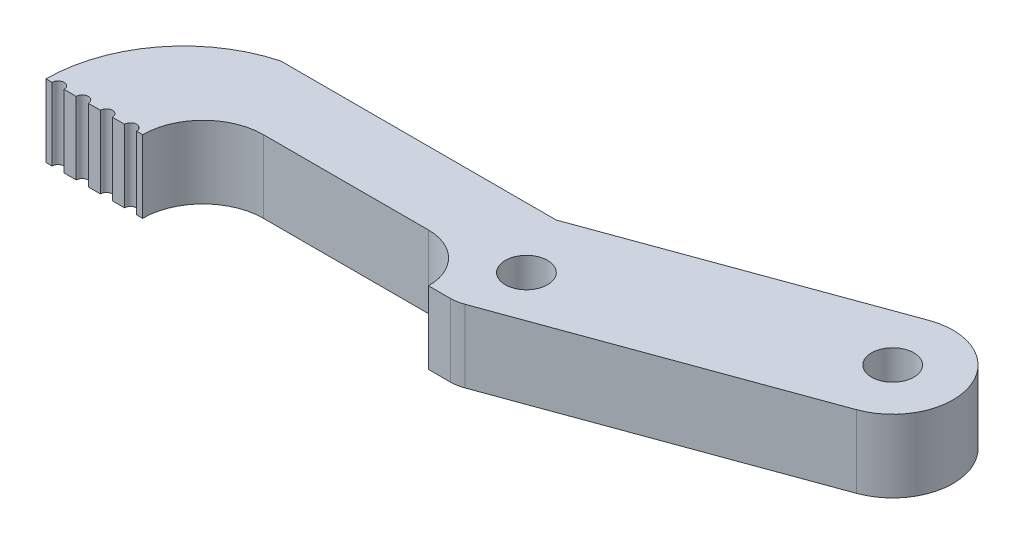
ISO-10303-21;
HEADER;
FILE_DESCRIPTION(('STEP AP214'),'2;1');
FILE_NAME('part.step','',(''),(''),'','','');
FILE_SCHEMA(('AUTOMOTIVE_DESIGN { 1 0 10303 214 1 1 1 1 }'));
ENDSEC;
DATA;
#1=APPLICATION_CONTEXT('core data for automotive mechanical design processes');
#2=APPLICATION_PROTOCOL_DEFINITION('international standard','automotive_design',2000,#1);
#3=PRODUCT_CONTEXT('',#1,'mechanical');
#4=PRODUCT('Part','Part','',(#3));
#5=PRODUCT_RELATED_PRODUCT_CATEGORY('part','',(#4));
#6=PRODUCT_DEFINITION_FORMATION('','',#4);
#7=PRODUCT_DEFINITION_CONTEXT('part definition',#1,'design');
#8=PRODUCT_DEFINITION('design','',#6,#7);
#9=PRODUCT_DEFINITION_SHAPE('','',#8);
#10=(LENGTH_UNIT() NAMED_UNIT(*) SI_UNIT(.MILLI.,.METRE.));
#11=(NAMED_UNIT(*) PLANE_ANGLE_UNIT() SI_UNIT($,.RADIAN.));
#12=(NAMED_UNIT(*) SI_UNIT($,.STERADIAN.) SOLID_ANGLE_UNIT());
#13=UNCERTAINTY_MEASURE_WITH_UNIT(LENGTH_MEASURE(1.E-05),#10,'distance_accuracy_value','');
#14=(GEOMETRIC_REPRESENTATION_CONTEXT(3) GLOBAL_UNCERTAINTY_ASSIGNED_CONTEXT((#13)) GLOBAL_UNIT_ASSIGNED_CONTEXT((#10,
#11,#12)) REPRESENTATION_CONTEXT('',''));
#15=CARTESIAN_POINT('',(0.,0.,0.));
#16=DIRECTION('',(0.,0.,1.));
#17=DIRECTION('',(1.,0.,0.));
#18=AXIS2_PLACEMENT_3D('',#15,#16,#17);
#19=CARTESIAN_POINT('',(-3.99167378230842,6.,0.));
#20=DIRECTION('',(0.,0.,-1.));
#21=DIRECTION('',(-1.,0.,0.));
#22=AXIS2_PLACEMENT_3D('',#19,#20,#21);
#23=PLANE('',#22);
#24=DIRECTION('',(1.,0.,0.));
#25=VECTOR('',#24,1.);
#26=CARTESIAN_POINT('',(-3.99167378230842,0.,0.));
#27=LINE('',#26,#25);
#28=CARTESIAN_POINT('',(-3.99167378230842,0.,0.));
#29=VERTEX_POINT('',#28);
#30=CARTESIAN_POINT('',(-3.49167378230842,0.,0.));
#31=VERTEX_POINT('',#30);
#32=EDGE_CURVE('E242',#29,#31,#27,.T.);
#33=ORIENTED_EDGE('',*,*,#32,.T.);
#34=DIRECTION('',(0.,1.,0.));
#35=VECTOR('',#34,1.);
#36=CARTESIAN_POINT('',(-3.49167378230842,0.,0.));
#37=LINE('',#36,#35);
#38=CARTESIAN_POINT('',(-3.49167378230842,6.,0.));
#39=VERTEX_POINT('',#38);
#40=EDGE_CURVE('E13',#31,#39,#37,.T.);
#41=ORIENTED_EDGE('',*,*,#40,.T.);
#42=DIRECTION('',(1.,0.,0.));
#43=VECTOR('',#42,1.);
#44=CARTESIAN_POINT('',(-3.99167378230842,6.,0.));
#45=LINE('',#44,#43);
#46=CARTESIAN_POINT('',(-3.99167378230842,6.,0.));
#47=VERTEX_POINT('',#46);
#48=EDGE_CURVE('E209',#47,#39,#45,.T.);
#49=ORIENTED_EDGE('',*,*,#48,.F.);
#50=DIRECTION('',(0.,-1.,0.));
#51=VECTOR('',#50,1.);
#52=CARTESIAN_POINT('',(-3.99167378230842,6.,0.));
#53=LINE('',#52,#51);
#54=EDGE_CURVE('E294',#47,#29,#53,.T.);
#55=ORIENTED_EDGE('',*,*,#54,.T.);
#56=EDGE_LOOP('',(#33,#41,#49,#55));
#57=FACE_BOUND('',#56,.T.);
#58=ADVANCED_FACE('F48',(#57),#23,.F.);
#59=CARTESIAN_POINT('',(-2.49167378230842,6.,0.));
#60=VERTEX_POINT('',#59);
#61=CARTESIAN_POINT('',(-1.49167378230842,6.,0.));
#62=VERTEX_POINT('',#61);
#63=EDGE_CURVE('E207',#60,#62,#45,.T.);
#64=ORIENTED_EDGE('',*,*,#63,.F.);
#65=DIRECTION('',(0.,1.,0.));
#66=VECTOR('',#65,1.);
#67=CARTESIAN_POINT('',(-2.49167378230842,0.,0.));
#68=LINE('',#67,#66);
#69=CARTESIAN_POINT('',(-2.49167378230842,0.,0.));
#70=VERTEX_POINT('',#69);
#71=EDGE_CURVE('E57',#60,#70,#68,.F.);
#72=ORIENTED_EDGE('',*,*,#71,.T.);
#73=CARTESIAN_POINT('',(-1.49167378230842,0.,0.));
#74=VERTEX_POINT('',#73);
#75=EDGE_CURVE('E246',#70,#74,#27,.T.);
#76=ORIENTED_EDGE('',*,*,#75,.T.);
#77=DIRECTION('',(0.,1.,0.));
#78=VECTOR('',#77,1.);
#79=CARTESIAN_POINT('',(-1.49167378230842,0.,0.));
#80=LINE('',#79,#78);
#81=EDGE_CURVE('E314',#74,#62,#80,.T.);
#82=ORIENTED_EDGE('',*,*,#81,.T.);
#83=EDGE_LOOP('',(#64,#72,#76,#82));
#84=FACE_BOUND('',#83,.T.);
#85=ADVANCED_FACE('F321',(#84),#23,.F.);
#86=CARTESIAN_POINT('',(1.50832621769158,0.,0.));
#87=VERTEX_POINT('',#86);
#88=CARTESIAN_POINT('',(2.50832621769158,0.,0.));
#89=VERTEX_POINT('',#88);
#90=EDGE_CURVE('E335',#87,#89,#27,.T.);
#91=ORIENTED_EDGE('',*,*,#90,.T.);
#92=DIRECTION('',(0.,1.,0.));
#93=VECTOR('',#92,1.);
#94=CARTESIAN_POINT('',(2.50832621769158,0.,0.));
#95=LINE('',#94,#93);
#96=CARTESIAN_POINT('',(2.50832621769158,6.,0.));
#97=VERTEX_POINT('',#96);
#98=EDGE_CURVE('E204',#89,#97,#95,.T.);
#99=ORIENTED_EDGE('',*,*,#98,.T.);
#100=CARTESIAN_POINT('',(1.50832621769158,6.,0.));
#101=VERTEX_POINT('',#100);
#102=EDGE_CURVE('E197',#101,#97,#45,.T.);
#103=ORIENTED_EDGE('',*,*,#102,.F.);
#104=DIRECTION('',(0.,1.,0.));
#105=VECTOR('',#104,1.);
#106=CARTESIAN_POINT('',(1.50832621769158,0.,0.));
#107=LINE('',#106,#105);
#108=EDGE_CURVE('E177',#101,#87,#107,.F.);
#109=ORIENTED_EDGE('',*,*,#108,.T.);
#110=EDGE_LOOP('',(#91,#99,#103,#109));
#111=FACE_BOUND('',#110,.T.);
#112=ADVANCED_FACE('F203',(#111),#23,.F.);
#113=CARTESIAN_POINT('',(-0.491673782308424,6.,0.));
#114=VERTEX_POINT('',#113);
#115=CARTESIAN_POINT('',(0.508326217691576,6.,0.));
#116=VERTEX_POINT('',#115);
#117=EDGE_CURVE('E200',#114,#116,#45,.T.);
#118=ORIENTED_EDGE('',*,*,#117,.F.);
#119=DIRECTION('',(0.,1.,0.));
#120=VECTOR('',#119,1.);
#121=CARTESIAN_POINT('',(-0.491673782308424,0.,0.));
#122=LINE('',#121,#120);
#123=CARTESIAN_POINT('',(-0.491673782308424,0.,0.));
#124=VERTEX_POINT('',#123);
#125=EDGE_CURVE('E311',#114,#124,#122,.F.);
#126=ORIENTED_EDGE('',*,*,#125,.T.);
#127=CARTESIAN_POINT('',(0.508326217691576,0.,0.));
#128=VERTEX_POINT('',#127);
#129=EDGE_CURVE('E333',#124,#128,#27,.T.);
#130=ORIENTED_EDGE('',*,*,#129,.T.);
#131=DIRECTION('',(0.,1.,0.));
#132=VECTOR('',#131,1.);
#133=CARTESIAN_POINT('',(0.508326217691576,0.,0.));
#134=LINE('',#133,#132);
#135=EDGE_CURVE('E187',#128,#116,#134,.T.);
#136=ORIENTED_EDGE('',*,*,#135,.T.);
#137=EDGE_LOOP('',(#118,#126,#130,#136));
#138=FACE_BOUND('',#137,.T.);
#139=ADVANCED_FACE('F412',(#138),#23,.F.);
#140=CARTESIAN_POINT('',(7.39771594295677,6.,0.));
#141=DIRECTION('',(0.,-1.,0.));
#142=DIRECTION('',(0.,0.,-1.));
#143=AXIS2_PLACEMENT_3D('',#140,#141,#142);
#144=PLANE('',#143);
#145=ORIENTED_EDGE('',*,*,#48,.T.);
#146=CARTESIAN_POINT('',(-2.99167378230842,6.,0.));
#147=DIRECTION('',(0.,1.,0.));
#148=DIRECTION('',(0.,0.,-1.));
#149=AXIS2_PLACEMENT_3D('',#146,#147,#148);
#150=CIRCLE('',#149,0.5);
#151=EDGE_CURVE('E368',#60,#39,#150,.T.);
#152=ORIENTED_EDGE('',*,*,#151,.F.);
#153=ORIENTED_EDGE('',*,*,#63,.T.);
#154=CARTESIAN_POINT('',(-0.991673782308424,6.,0.));
#155=DIRECTION('',(0.,1.,0.));
#156=DIRECTION('',(0.,0.,-1.));
#157=AXIS2_PLACEMENT_3D('',#154,#155,#156);
#158=CIRCLE('',#157,0.5);
#159=EDGE_CURVE('E363',#114,#62,#158,.T.);
#160=ORIENTED_EDGE('',*,*,#159,.F.);
#161=ORIENTED_EDGE('',*,*,#117,.T.);
#162=CARTESIAN_POINT('',(1.00832621769158,6.,0.));
#163=DIRECTION('',(0.,1.,0.));
#164=DIRECTION('',(0.,0.,1.));
#165=AXIS2_PLACEMENT_3D('',#162,#163,#164);
#166=CIRCLE('',#165,0.5);
#167=EDGE_CURVE('E180',#101,#116,#166,.T.);
#168=ORIENTED_EDGE('',*,*,#167,.F.);
#169=ORIENTED_EDGE('',*,*,#102,.T.);
#170=CARTESIAN_POINT('',(3.00832621769158,6.,0.));
#171=DIRECTION('',(0.,1.,0.));
#172=DIRECTION('',(0.,0.,1.));
#173=AXIS2_PLACEMENT_3D('',#170,#171,#172);
#174=CIRCLE('',#173,0.5);
#175=CARTESIAN_POINT('',(3.50832621769158,6.,0.));
#176=VERTEX_POINT('',#175);
#177=EDGE_CURVE('E360',#176,#97,#174,.T.);
#178=ORIENTED_EDGE('',*,*,#177,.F.);
#179=CARTESIAN_POINT('',(4.00832621769158,6.,0.));
#180=VERTEX_POINT('',#179);
#181=EDGE_CURVE('E205',#176,#180,#45,.T.);
#182=ORIENTED_EDGE('',*,*,#181,.T.);
#183=CARTESIAN_POINT('',(9.00832621769158,6.,0.));
#184=DIRECTION('',(0.,-1.,0.));
#185=DIRECTION('',(0.,0.,-1.));
#186=AXIS2_PLACEMENT_3D('',#183,#184,#185);
#187=CIRCLE('',#186,5.);
#188=CARTESIAN_POINT('',(9.00832621769158,6.,-5.));
#189=VERTEX_POINT('',#188);
#190=EDGE_CURVE('E212',#180,#189,#187,.T.);
#191=ORIENTED_EDGE('',*,*,#190,.T.);
#192=DIRECTION('',(1.,0.,0.));
#193=VECTOR('',#192,1.);
#194=CARTESIAN_POINT('',(9.00832621769158,6.,-5.));
#195=LINE('',#194,#193);
#196=CARTESIAN_POINT('',(22.6817866035223,6.,-5.));
#197=VERTEX_POINT('',#196);
#198=EDGE_CURVE('E215',#189,#197,#195,.T.);
#199=ORIENTED_EDGE('',*,*,#198,.T.);
#200=CARTESIAN_POINT('',(22.6817866035223,6.,-0.999999999999999));
#201=DIRECTION('',(0.,-1.,0.));
#202=DIRECTION('',(0.,0.,-1.));
#203=AXIS2_PLACEMENT_3D('',#200,#201,#202);
#204=CIRCLE('',#203,4.);
#205=CARTESIAN_POINT('',(26.6817866035223,6.,-0.999999999999999));
#206=VERTEX_POINT('',#205);
#207=EDGE_CURVE('E218',#197,#206,#204,.T.);
#208=ORIENTED_EDGE('',*,*,#207,.T.);
#209=DIRECTION('',(1.,0.,0.));
#210=VECTOR('',#209,1.);
#211=CARTESIAN_POINT('',(26.6817866035223,6.,-0.999999999999999));
#212=LINE('',#211,#210);
#213=CARTESIAN_POINT('',(28.4793452755662,6.,-0.999999999999999));
#214=VERTEX_POINT('',#213);
#215=EDGE_CURVE('E221',#206,#214,#212,.T.);
#216=ORIENTED_EDGE('',*,*,#215,.T.);
#217=CARTESIAN_POINT('',(28.4793452755662,6.,-4.));
#218=DIRECTION('',(0.,-1.,0.));
#219=DIRECTION('',(0.,0.,-1.));
#220=AXIS2_PLACEMENT_3D('',#217,#218,#219);
#221=CIRCLE('',#220,3.);
#222=CARTESIAN_POINT('',(29.5054057055432,6.,-1.18092213764228));
#223=VERTEX_POINT('',#222);
#224=EDGE_CURVE('E188',#214,#223,#221,.F.);
#225=ORIENTED_EDGE('',*,*,#224,.T.);
#226=DIRECTION('',(0.939692620785908,0.,-0.34202014332567));
#227=VECTOR('',#226,1.);
#228=CARTESIAN_POINT('',(29.0083262176916,6.,-0.999999999999999));
#229=LINE('',#228,#227);
#230=CARTESIAN_POINT('',(53.2806502121784,6.,-9.83440345045856));
#231=VERTEX_POINT('',#230);
#232=EDGE_CURVE('E225',#223,#231,#229,.T.);
#233=ORIENTED_EDGE('',*,*,#232,.T.);
#234=CARTESIAN_POINT('',(51.57054949555,6.,-14.5328665543881));
#235=DIRECTION('',(0.,1.,0.));
#236=DIRECTION('',(0.,0.,1.));
#237=AXIS2_PLACEMENT_3D('',#234,#235,#236);
#238=CIRCLE('',#237,5.);
#239=CARTESIAN_POINT('',(49.8604487789217,6.,-19.2313296583176));
#240=VERTEX_POINT('',#239);
#241=EDGE_CURVE('E228',#231,#240,#238,.T.);
#242=ORIENTED_EDGE('',*,*,#241,.T.);
#243=DIRECTION('',(-0.939692620785908,0.,0.34202014332567));
#244=VECTOR('',#243,1.);
#245=CARTESIAN_POINT('',(27.2450564106069,6.,-11.));
#246=LINE('',#245,#244);
#247=CARTESIAN_POINT('',(27.2450564106069,6.,-11.));
#248=VERTEX_POINT('',#247);
#249=EDGE_CURVE('E230',#240,#248,#246,.T.);
#250=ORIENTED_EDGE('',*,*,#249,.T.);
#251=DIRECTION('',(-1.,0.,0.));
#252=VECTOR('',#251,1.);
#253=CARTESIAN_POINT('',(4.44505641060692,6.,-11.));
#254=LINE('',#253,#252);
#255=CARTESIAN_POINT('',(4.44505641060692,6.,-11.));
#256=VERTEX_POINT('',#255);
#257=EDGE_CURVE('E233',#248,#256,#254,.T.);
#258=ORIENTED_EDGE('',*,*,#257,.T.);
#259=CARTESIAN_POINT('',(7.39771594295677,6.,0.));
#260=DIRECTION('',(0.,1.,0.));
#261=DIRECTION('',(0.,0.,-1.));
#262=AXIS2_PLACEMENT_3D('',#259,#260,#261);
#263=CIRCLE('',#262,11.3893897252652);
#264=EDGE_CURVE('E208',#256,#47,#263,.T.);
#265=ORIENTED_EDGE('',*,*,#264,.T.);
#266=EDGE_LOOP('',(#145,#152,#153,#160,#161,#168,#169,#178,#182,#191,#199,#208,#216,#225,#233,
#242,#250,#258,#265));
#267=FACE_BOUND('',#266,.T.);
#268=CARTESIAN_POINT('',(51.57054949555,6.,-14.5328665543881));
#269=DIRECTION('',(0.,1.,0.));
#270=DIRECTION('',(0.,0.,1.));
#271=AXIS2_PLACEMENT_3D('',#268,#269,#270);
#272=CIRCLE('',#271,1.75);
#273=CARTESIAN_POINT('',(51.57054949555,6.,-12.7828665543881));
#274=VERTEX_POINT('',#273);
#275=EDGE_CURVE('E241',#274,#274,#272,.T.);
#276=ORIENTED_EDGE('',*,*,#275,.F.);
#277=EDGE_LOOP('',(#276));
#278=FACE_BOUND('',#277,.T.);
#279=CARTESIAN_POINT('',(29.7817866035223,6.,-6.));
#280=DIRECTION('',(0.,1.,0.));
#281=DIRECTION('',(0.,0.,1.));
#282=AXIS2_PLACEMENT_3D('',#279,#280,#281);
#283=CIRCLE('',#282,1.75);
#284=CARTESIAN_POINT('',(29.7817866035223,6.,-4.25));
#285=VERTEX_POINT('',#284);
#286=EDGE_CURVE('E372',#285,#285,#283,.T.);
#287=ORIENTED_EDGE('',*,*,#286,.F.);
#288=EDGE_LOOP('',(#287));
#289=FACE_BOUND('',#288,.T.);
#290=ADVANCED_FACE('F194',(#267,#278,#289),#144,.F.);
#291=CARTESIAN_POINT('',(7.39771594295677,0.,0.));
#292=DIRECTION('',(0.,-1.,0.));
#293=DIRECTION('',(0.,0.,-1.));
#294=AXIS2_PLACEMENT_3D('',#291,#292,#293);
#295=PLANE('',#294);
#296=CARTESIAN_POINT('',(-2.99167378230842,0.,0.));
#297=DIRECTION('',(0.,1.,0.));
#298=DIRECTION('',(0.,0.,-1.));
#299=AXIS2_PLACEMENT_3D('',#296,#297,#298);
#300=CIRCLE('',#299,0.5);
#301=EDGE_CURVE('E330',#70,#31,#300,.T.);
#302=ORIENTED_EDGE('',*,*,#301,.T.);
#303=ORIENTED_EDGE('',*,*,#32,.F.);
#304=CARTESIAN_POINT('',(7.39771594295677,0.,0.));
#305=DIRECTION('',(0.,1.,0.));
#306=DIRECTION('',(0.,0.,-1.));
#307=AXIS2_PLACEMENT_3D('',#304,#305,#306);
#308=CIRCLE('',#307,11.3893897252652);
#309=CARTESIAN_POINT('',(4.44505641060692,0.,-11.));
#310=VERTEX_POINT('',#309);
#311=EDGE_CURVE('E237',#310,#29,#308,.T.);
#312=ORIENTED_EDGE('',*,*,#311,.F.);
#313=DIRECTION('',(-1.,0.,0.));
#314=VECTOR('',#313,1.);
#315=CARTESIAN_POINT('',(4.44505641060692,0.,-11.));
#316=LINE('',#315,#314);
#317=CARTESIAN_POINT('',(27.2450564106069,0.,-11.));
#318=VERTEX_POINT('',#317);
#319=EDGE_CURVE('E267',#318,#310,#316,.T.);
#320=ORIENTED_EDGE('',*,*,#319,.F.);
#321=DIRECTION('',(-0.939692620785908,0.,0.34202014332567));
#322=VECTOR('',#321,1.);
#323=CARTESIAN_POINT('',(27.2450564106069,0.,-11.));
#324=LINE('',#323,#322);
#325=CARTESIAN_POINT('',(49.8604487789217,0.,-19.2313296583176));
#326=VERTEX_POINT('',#325);
#327=EDGE_CURVE('E264',#326,#318,#324,.T.);
#328=ORIENTED_EDGE('',*,*,#327,.F.);
#329=CARTESIAN_POINT('',(51.57054949555,0.,-14.5328665543881));
#330=DIRECTION('',(0.,1.,0.));
#331=DIRECTION('',(0.,0.,1.));
#332=AXIS2_PLACEMENT_3D('',#329,#330,#331);
#333=CIRCLE('',#332,5.);
#334=CARTESIAN_POINT('',(53.2806502121784,0.,-9.83440345045856));
#335=VERTEX_POINT('',#334);
#336=EDGE_CURVE('E261',#335,#326,#333,.T.);
#337=ORIENTED_EDGE('',*,*,#336,.F.);
#338=DIRECTION('',(0.939692620785908,0.,-0.34202014332567));
#339=VECTOR('',#338,1.);
#340=CARTESIAN_POINT('',(29.0083262176916,0.,-0.999999999999999));
#341=LINE('',#340,#339);
#342=CARTESIAN_POINT('',(29.5054057055432,0.,-1.18092213764228));
#343=VERTEX_POINT('',#342);
#344=EDGE_CURVE('E258',#343,#335,#341,.T.);
#345=ORIENTED_EDGE('',*,*,#344,.F.);
#346=CARTESIAN_POINT('',(28.4793452755662,0.,-4.));
#347=DIRECTION('',(0.,-1.,0.));
#348=DIRECTION('',(0.,0.,-1.));
#349=AXIS2_PLACEMENT_3D('',#346,#347,#348);
#350=CIRCLE('',#349,3.);
#351=CARTESIAN_POINT('',(28.4793452755662,0.,-0.999999999999999));
#352=VERTEX_POINT('',#351);
#353=EDGE_CURVE('E301',#343,#352,#350,.T.);
#354=ORIENTED_EDGE('',*,*,#353,.T.);
#355=DIRECTION('',(1.,0.,0.));
#356=VECTOR('',#355,1.);
#357=CARTESIAN_POINT('',(26.6817866035223,0.,-0.999999999999999));
#358=LINE('',#357,#356);
#359=CARTESIAN_POINT('',(26.6817866035223,0.,-0.999999999999999));
#360=VERTEX_POINT('',#359);
#361=EDGE_CURVE('E255',#360,#352,#358,.T.);
#362=ORIENTED_EDGE('',*,*,#361,.F.);
#363=CARTESIAN_POINT('',(22.6817866035223,0.,-0.999999999999999));
#364=DIRECTION('',(0.,-1.,0.));
#365=DIRECTION('',(0.,0.,-1.));
#366=AXIS2_PLACEMENT_3D('',#363,#364,#365);
#367=CIRCLE('',#366,4.);
#368=CARTESIAN_POINT('',(22.6817866035223,0.,-5.));
#369=VERTEX_POINT('',#368);
#370=EDGE_CURVE('E252',#369,#360,#367,.T.);
#371=ORIENTED_EDGE('',*,*,#370,.F.);
#372=DIRECTION('',(1.,0.,0.));
#373=VECTOR('',#372,1.);
#374=CARTESIAN_POINT('',(9.00832621769158,0.,-5.));
#375=LINE('',#374,#373);
#376=CARTESIAN_POINT('',(9.00832621769158,0.,-5.));
#377=VERTEX_POINT('',#376);
#378=EDGE_CURVE('E249',#377,#369,#375,.T.);
#379=ORIENTED_EDGE('',*,*,#378,.F.);
#380=CARTESIAN_POINT('',(9.00832621769158,0.,0.));
#381=DIRECTION('',(0.,-1.,0.));
#382=DIRECTION('',(0.,0.,-1.));
#383=AXIS2_PLACEMENT_3D('',#380,#381,#382);
#384=CIRCLE('',#383,5.);
#385=CARTESIAN_POINT('',(4.00832621769158,0.,0.));
#386=VERTEX_POINT('',#385);
#387=EDGE_CURVE('E245',#386,#377,#384,.T.);
#388=ORIENTED_EDGE('',*,*,#387,.F.);
#389=CARTESIAN_POINT('',(3.50832621769158,0.,0.));
#390=VERTEX_POINT('',#389);
#391=EDGE_CURVE('E240',#390,#386,#27,.T.);
#392=ORIENTED_EDGE('',*,*,#391,.F.);
#393=CARTESIAN_POINT('',(3.00832621769158,0.,0.));
#394=DIRECTION('',(0.,1.,0.));
#395=DIRECTION('',(0.,0.,1.));
#396=AXIS2_PLACEMENT_3D('',#393,#394,#395);
#397=CIRCLE('',#396,0.5);
#398=EDGE_CURVE('E64',#390,#89,#397,.T.);
#399=ORIENTED_EDGE('',*,*,#398,.T.);
#400=ORIENTED_EDGE('',*,*,#90,.F.);
#401=CARTESIAN_POINT('',(1.00832621769158,0.,0.));
#402=DIRECTION('',(0.,1.,0.));
#403=DIRECTION('',(0.,0.,1.));
#404=AXIS2_PLACEMENT_3D('',#401,#402,#403);
#405=CIRCLE('',#404,0.5);
#406=EDGE_CURVE('E72',#87,#128,#405,.T.);
#407=ORIENTED_EDGE('',*,*,#406,.T.);
#408=ORIENTED_EDGE('',*,*,#129,.F.);
#409=CARTESIAN_POINT('',(-0.991673782308424,0.,0.));
#410=DIRECTION('',(0.,1.,0.));
#411=DIRECTION('',(0.,0.,-1.));
#412=AXIS2_PLACEMENT_3D('',#409,#410,#411);
#413=CIRCLE('',#412,0.5);
#414=EDGE_CURVE('E332',#124,#74,#413,.T.);
#415=ORIENTED_EDGE('',*,*,#414,.T.);
#416=ORIENTED_EDGE('',*,*,#75,.F.);
#417=EDGE_LOOP('',(#302,#303,#312,#320,#328,#337,#345,#354,#362,#371,#379,#388,#392,#399,#400,
#407,#408,#415,#416));
#418=FACE_BOUND('',#417,.T.);
#419=CARTESIAN_POINT('',(51.57054949555,0.,-14.5328665543881));
#420=DIRECTION('',(0.,1.,0.));
#421=DIRECTION('',(0.,0.,1.));
#422=AXIS2_PLACEMENT_3D('',#419,#420,#421);
#423=CIRCLE('',#422,1.75);
#424=CARTESIAN_POINT('',(51.57054949555,0.,-12.7828665543881));
#425=VERTEX_POINT('',#424);
#426=EDGE_CURVE('E376',#425,#425,#423,.T.);
#427=ORIENTED_EDGE('',*,*,#426,.T.);
#428=EDGE_LOOP('',(#427));
#429=FACE_BOUND('',#428,.T.);
#430=CARTESIAN_POINT('',(29.7817866035223,0.,-6.));
#431=DIRECTION('',(0.,1.,0.));
#432=DIRECTION('',(0.,0.,1.));
#433=AXIS2_PLACEMENT_3D('',#430,#431,#432);
#434=CIRCLE('',#433,1.75);
#435=CARTESIAN_POINT('',(29.7817866035223,0.,-4.25));
#436=VERTEX_POINT('',#435);
#437=EDGE_CURVE('E370',#436,#436,#434,.T.);
#438=ORIENTED_EDGE('',*,*,#437,.T.);
#439=EDGE_LOOP('',(#438));
#440=FACE_BOUND('',#439,.T.);
#441=ADVANCED_FACE('F328',(#418,#429,#440),#295,.T.);
#442=CARTESIAN_POINT('',(7.39771594295677,6.,0.));
#443=DIRECTION('',(0.,-1.,0.));
#444=DIRECTION('',(0.,0.,-1.));
#445=AXIS2_PLACEMENT_3D('',#442,#443,#444);
#446=CYLINDRICAL_SURFACE('',#445,11.3893897252652);
#447=ORIENTED_EDGE('',*,*,#311,.T.);
#448=ORIENTED_EDGE('',*,*,#54,.F.);
#449=ORIENTED_EDGE('',*,*,#264,.F.);
#450=DIRECTION('',(0.,-1.,0.));
#451=VECTOR('',#450,1.);
#452=CARTESIAN_POINT('',(4.44505641060692,6.,-11.));
#453=LINE('',#452,#451);
#454=EDGE_CURVE('E236',#256,#310,#453,.T.);
#455=ORIENTED_EDGE('',*,*,#454,.T.);
#456=EDGE_LOOP('',(#447,#448,#449,#455));
#457=FACE_BOUND('',#456,.T.);
#458=ADVANCED_FACE('F411',(#457),#446,.T.);
#459=ORIENTED_EDGE('',*,*,#181,.F.);
#460=DIRECTION('',(0.,1.,0.));
#461=VECTOR('',#460,1.);
#462=CARTESIAN_POINT('',(3.50832621769158,0.,0.));
#463=LINE('',#462,#461);
#464=EDGE_CURVE('E308',#176,#390,#463,.F.);
#465=ORIENTED_EDGE('',*,*,#464,.T.);
#466=ORIENTED_EDGE('',*,*,#391,.T.);
#467=DIRECTION('',(0.,-1.,0.));
#468=VECTOR('',#467,1.);
#469=CARTESIAN_POINT('',(4.00832621769158,6.,0.));
#470=LINE('',#469,#468);
#471=EDGE_CURVE('E291',#180,#386,#470,.T.);
#472=ORIENTED_EDGE('',*,*,#471,.F.);
#473=EDGE_LOOP('',(#459,#465,#466,#472));
#474=FACE_BOUND('',#473,.T.);
#475=ADVANCED_FACE('F341',(#474),#23,.F.);
#476=CARTESIAN_POINT('',(9.00832621769158,6.,0.));
#477=DIRECTION('',(0.,-1.,0.));
#478=DIRECTION('',(0.,0.,-1.));
#479=AXIS2_PLACEMENT_3D('',#476,#477,#478);
#480=CYLINDRICAL_SURFACE('',#479,5.);
#481=ORIENTED_EDGE('',*,*,#387,.T.);
#482=DIRECTION('',(0.,-1.,0.));
#483=VECTOR('',#482,1.);
#484=CARTESIAN_POINT('',(9.00832621769158,6.,-5.));
#485=LINE('',#484,#483);
#486=EDGE_CURVE('E288',#189,#377,#485,.T.);
#487=ORIENTED_EDGE('',*,*,#486,.F.);
#488=ORIENTED_EDGE('',*,*,#190,.F.);
#489=ORIENTED_EDGE('',*,*,#471,.T.);
#490=EDGE_LOOP('',(#481,#487,#488,#489));
#491=FACE_BOUND('',#490,.T.);
#492=ADVANCED_FACE('F345',(#491),#480,.F.);
#493=CARTESIAN_POINT('',(9.00832621769158,6.,-5.));
#494=DIRECTION('',(0.,0.,-1.));
#495=DIRECTION('',(-1.,0.,0.));
#496=AXIS2_PLACEMENT_3D('',#493,#494,#495);
#497=PLANE('',#496);
#498=ORIENTED_EDGE('',*,*,#378,.T.);
#499=DIRECTION('',(0.,-1.,0.));
#500=VECTOR('',#499,1.);
#501=CARTESIAN_POINT('',(22.6817866035223,6.,-5.));
#502=LINE('',#501,#500);
#503=EDGE_CURVE('E285',#197,#369,#502,.T.);
#504=ORIENTED_EDGE('',*,*,#503,.F.);
#505=ORIENTED_EDGE('',*,*,#198,.F.);
#506=ORIENTED_EDGE('',*,*,#486,.T.);
#507=EDGE_LOOP('',(#498,#504,#505,#506));
#508=FACE_BOUND('',#507,.T.);
#509=ADVANCED_FACE('F352',(#508),#497,.F.);
#510=CARTESIAN_POINT('',(22.6817866035223,6.,-0.999999999999999));
#511=DIRECTION('',(0.,-1.,0.));
#512=DIRECTION('',(0.,0.,-1.));
#513=AXIS2_PLACEMENT_3D('',#510,#511,#512);
#514=CYLINDRICAL_SURFACE('',#513,4.);
#515=ORIENTED_EDGE('',*,*,#370,.T.);
#516=DIRECTION('',(0.,-1.,0.));
#517=VECTOR('',#516,1.);
#518=CARTESIAN_POINT('',(26.6817866035223,6.,-0.999999999999999));
#519=LINE('',#518,#517);
#520=EDGE_CURVE('E282',#206,#360,#519,.T.);
#521=ORIENTED_EDGE('',*,*,#520,.F.);
#522=ORIENTED_EDGE('',*,*,#207,.F.);
#523=ORIENTED_EDGE('',*,*,#503,.T.);
#524=EDGE_LOOP('',(#515,#521,#522,#523));
#525=FACE_BOUND('',#524,.T.);
#526=ADVANCED_FACE('F356',(#525),#514,.F.);
#527=CARTESIAN_POINT('',(26.6817866035223,6.,-0.999999999999999));
#528=DIRECTION('',(0.,0.,-1.));
#529=DIRECTION('',(-1.,0.,0.));
#530=AXIS2_PLACEMENT_3D('',#527,#528,#529);
#531=PLANE('',#530);
#532=ORIENTED_EDGE('',*,*,#361,.T.);
#533=DIRECTION('',(0.,-1.,0.));
#534=VECTOR('',#533,1.);
#535=CARTESIAN_POINT('',(28.4793452755662,6.,-0.999999999999999));
#536=LINE('',#535,#534);
#537=EDGE_CURVE('E304',#352,#214,#536,.F.);
#538=ORIENTED_EDGE('',*,*,#537,.T.);
#539=ORIENTED_EDGE('',*,*,#215,.F.);
#540=ORIENTED_EDGE('',*,*,#520,.T.);
#541=EDGE_LOOP('',(#532,#538,#539,#540));
#542=FACE_BOUND('',#541,.T.);
#543=ADVANCED_FACE('F451',(#542),#531,.F.);
#544=CARTESIAN_POINT('',(29.0083262176916,6.,-0.999999999999999));
#545=DIRECTION('',(-0.34202014332567,0.,-0.939692620785908));
#546=DIRECTION('',(-0.939692620785908,0.,0.34202014332567));
#547=AXIS2_PLACEMENT_3D('',#544,#545,#546);
#548=PLANE('',#547);
#549=ORIENTED_EDGE('',*,*,#232,.F.);
#550=DIRECTION('',(0.,-1.,0.));
#551=VECTOR('',#550,1.);
#552=CARTESIAN_POINT('',(29.5054057055432,6.,-1.18092213764228));
#553=LINE('',#552,#551);
#554=EDGE_CURVE('E298',#223,#343,#553,.T.);
#555=ORIENTED_EDGE('',*,*,#554,.T.);
#556=ORIENTED_EDGE('',*,*,#344,.T.);
#557=DIRECTION('',(0.,-1.,0.));
#558=VECTOR('',#557,1.);
#559=CARTESIAN_POINT('',(53.2806502121784,6.,-9.83440345045856));
#560=LINE('',#559,#558);
#561=EDGE_CURVE('E279',#231,#335,#560,.T.);
#562=ORIENTED_EDGE('',*,*,#561,.F.);
#563=EDGE_LOOP('',(#549,#555,#556,#562));
#564=FACE_BOUND('',#563,.T.);
#565=ADVANCED_FACE('F446',(#564),#548,.F.);
#566=CARTESIAN_POINT('',(51.57054949555,6.,-14.5328665543881));
#567=DIRECTION('',(0.,-1.,0.));
#568=DIRECTION('',(0.,0.,-1.));
#569=AXIS2_PLACEMENT_3D('',#566,#567,#568);
#570=CYLINDRICAL_SURFACE('',#569,5.);
#571=ORIENTED_EDGE('',*,*,#336,.T.);
#572=DIRECTION('',(0.,-1.,0.));
#573=VECTOR('',#572,1.);
#574=CARTESIAN_POINT('',(49.8604487789217,6.,-19.2313296583176));
#575=LINE('',#574,#573);
#576=EDGE_CURVE('E276',#240,#326,#575,.T.);
#577=ORIENTED_EDGE('',*,*,#576,.F.);
#578=ORIENTED_EDGE('',*,*,#241,.F.);
#579=ORIENTED_EDGE('',*,*,#561,.T.);
#580=EDGE_LOOP('',(#571,#577,#578,#579));
#581=FACE_BOUND('',#580,.T.);
#582=ADVANCED_FACE('F441',(#581),#570,.T.);
#583=CARTESIAN_POINT('',(27.2450564106069,6.,-11.));
#584=DIRECTION('',(0.34202014332567,0.,0.939692620785908));
#585=DIRECTION('',(0.939692620785908,0.,-0.34202014332567));
#586=AXIS2_PLACEMENT_3D('',#583,#584,#585);
#587=PLANE('',#586);
#588=ORIENTED_EDGE('',*,*,#327,.T.);
#589=DIRECTION('',(0.,-1.,0.));
#590=VECTOR('',#589,1.);
#591=CARTESIAN_POINT('',(27.2450564106069,6.,-11.));
#592=LINE('',#591,#590);
#593=EDGE_CURVE('E272',#248,#318,#592,.T.);
#594=ORIENTED_EDGE('',*,*,#593,.F.);
#595=ORIENTED_EDGE('',*,*,#249,.F.);
#596=ORIENTED_EDGE('',*,*,#576,.T.);
#597=EDGE_LOOP('',(#588,#594,#595,#596));
#598=FACE_BOUND('',#597,.T.);
#599=ADVANCED_FACE('F399',(#598),#587,.F.);
#600=CARTESIAN_POINT('',(4.44505641060692,6.,-11.));
#601=DIRECTION('',(0.,0.,1.));
#602=DIRECTION('',(1.,0.,0.));
#603=AXIS2_PLACEMENT_3D('',#600,#601,#602);
#604=PLANE('',#603);
#605=ORIENTED_EDGE('',*,*,#319,.T.);
#606=ORIENTED_EDGE('',*,*,#454,.F.);
#607=ORIENTED_EDGE('',*,*,#257,.F.);
#608=ORIENTED_EDGE('',*,*,#593,.T.);
#609=EDGE_LOOP('',(#605,#606,#607,#608));
#610=FACE_BOUND('',#609,.T.);
#611=ADVANCED_FACE('F390',(#610),#604,.F.);
#612=CARTESIAN_POINT('',(51.57054949555,6.,-14.5328665543881));
#613=DIRECTION('',(0.,-1.,0.));
#614=DIRECTION('',(0.,0.,-1.));
#615=AXIS2_PLACEMENT_3D('',#612,#613,#614);
#616=CYLINDRICAL_SURFACE('',#615,1.75);
#617=ORIENTED_EDGE('',*,*,#275,.T.);
#618=EDGE_LOOP('',(#617));
#619=FACE_BOUND('',#618,.T.);
#620=ORIENTED_EDGE('',*,*,#426,.F.);
#621=EDGE_LOOP('',(#620));
#622=FACE_BOUND('',#621,.T.);
#623=ADVANCED_FACE('F387',(#619,#622),#616,.F.);
#624=CARTESIAN_POINT('',(29.7817866035223,6.,-6.));
#625=DIRECTION('',(0.,-1.,0.));
#626=DIRECTION('',(0.,0.,-1.));
#627=AXIS2_PLACEMENT_3D('',#624,#625,#626);
#628=CYLINDRICAL_SURFACE('',#627,1.75);
#629=ORIENTED_EDGE('',*,*,#286,.T.);
#630=EDGE_LOOP('',(#629));
#631=FACE_BOUND('',#630,.T.);
#632=ORIENTED_EDGE('',*,*,#437,.F.);
#633=EDGE_LOOP('',(#632));
#634=FACE_BOUND('',#633,.T.);
#635=ADVANCED_FACE('F389',(#631,#634),#628,.F.);
#636=CARTESIAN_POINT('',(28.4793452755662,6.,-4.));
#637=DIRECTION('',(0.,-1.,0.));
#638=DIRECTION('',(0.,0.,-1.));
#639=AXIS2_PLACEMENT_3D('',#636,#637,#638);
#640=CYLINDRICAL_SURFACE('',#639,3.);
#641=ORIENTED_EDGE('',*,*,#224,.F.);
#642=ORIENTED_EDGE('',*,*,#537,.F.);
#643=ORIENTED_EDGE('',*,*,#353,.F.);
#644=ORIENTED_EDGE('',*,*,#554,.F.);
#645=EDGE_LOOP('',(#641,#642,#643,#644));
#646=FACE_BOUND('',#645,.T.);
#647=ADVANCED_FACE('F50',(#646),#640,.T.);
#648=CARTESIAN_POINT('',(1.00832621769158,0.,0.));
#649=DIRECTION('',(0.,1.,0.));
#650=DIRECTION('',(0.,0.,1.));
#651=AXIS2_PLACEMENT_3D('',#648,#649,#650);
#652=CYLINDRICAL_SURFACE('',#651,0.5);
#653=ORIENTED_EDGE('',*,*,#406,.F.);
#654=ORIENTED_EDGE('',*,*,#108,.F.);
#655=ORIENTED_EDGE('',*,*,#167,.T.);
#656=ORIENTED_EDGE('',*,*,#135,.F.);
#657=EDGE_LOOP('',(#653,#654,#655,#656));
#658=FACE_BOUND('',#657,.T.);
#659=ADVANCED_FACE('F179',(#658),#652,.F.);
#660=CARTESIAN_POINT('',(3.00832621769158,0.,0.));
#661=DIRECTION('',(0.,1.,0.));
#662=DIRECTION('',(0.,0.,1.));
#663=AXIS2_PLACEMENT_3D('',#660,#661,#662);
#664=CYLINDRICAL_SURFACE('',#663,0.5);
#665=ORIENTED_EDGE('',*,*,#398,.F.);
#666=ORIENTED_EDGE('',*,*,#464,.F.);
#667=ORIENTED_EDGE('',*,*,#177,.T.);
#668=ORIENTED_EDGE('',*,*,#98,.F.);
#669=EDGE_LOOP('',(#665,#666,#667,#668));
#670=FACE_BOUND('',#669,.T.);
#671=ADVANCED_FACE('F573',(#670),#664,.F.);
#672=CARTESIAN_POINT('',(-0.991673782308424,0.,0.));
#673=DIRECTION('',(0.,1.,0.));
#674=DIRECTION('',(0.,0.,1.));
#675=AXIS2_PLACEMENT_3D('',#672,#673,#674);
#676=CYLINDRICAL_SURFACE('',#675,0.5);
#677=ORIENTED_EDGE('',*,*,#414,.F.);
#678=ORIENTED_EDGE('',*,*,#125,.F.);
#679=ORIENTED_EDGE('',*,*,#159,.T.);
#680=ORIENTED_EDGE('',*,*,#81,.F.);
#681=EDGE_LOOP('',(#677,#678,#679,#680));
#682=FACE_BOUND('',#681,.T.);
#683=ADVANCED_FACE('F424',(#682),#676,.F.);
#684=CARTESIAN_POINT('',(-2.99167378230842,0.,0.));
#685=DIRECTION('',(0.,1.,0.));
#686=DIRECTION('',(0.,0.,1.));
#687=AXIS2_PLACEMENT_3D('',#684,#685,#686);
#688=CYLINDRICAL_SURFACE('',#687,0.5);
#689=ORIENTED_EDGE('',*,*,#301,.F.);
#690=ORIENTED_EDGE('',*,*,#71,.F.);
#691=ORIENTED_EDGE('',*,*,#151,.T.);
#692=ORIENTED_EDGE('',*,*,#40,.F.);
#693=EDGE_LOOP('',(#689,#690,#691,#692));
#694=FACE_BOUND('',#693,.T.);
#695=ADVANCED_FACE('F426',(#694),#688,.F.);
#696=CLOSED_SHELL('',(#58,#85,#112,#139,#290,#441,#458,#475,#492,#509,#526,#543,#565,#582,#599,
#611,#623,#635,#647,#659,#671,#683,#695));
#697=MANIFOLD_SOLID_BREP('B2',#696);
#698=ADVANCED_BREP_SHAPE_REPRESENTATION('',(#18,#697),#14);
#699=SHAPE_DEFINITION_REPRESENTATION(#9,#698);
ENDSEC;
END-ISO-10303-21;
